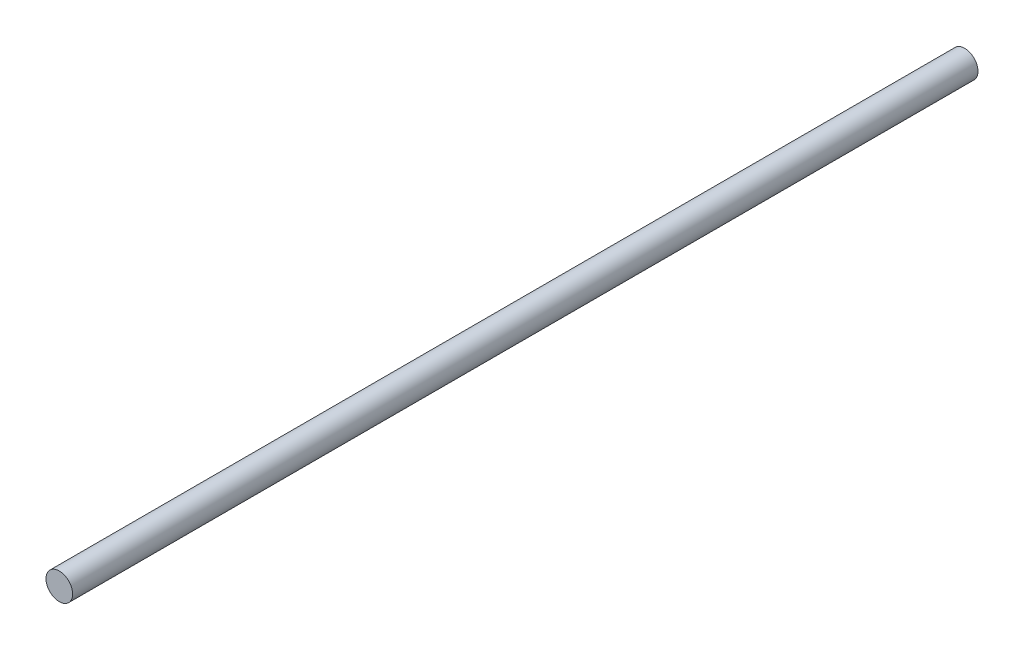
ISO-10303-21;
HEADER;
FILE_DESCRIPTION(('STEP AP214'),'2;1');
FILE_NAME('part.step','',(''),(''),'','','');
FILE_SCHEMA(('AUTOMOTIVE_DESIGN { 1 0 10303 214 1 1 1 1 }'));
ENDSEC;
DATA;
#1=APPLICATION_CONTEXT('core data for automotive mechanical design processes');
#2=APPLICATION_PROTOCOL_DEFINITION('international standard','automotive_design',2000,#1);
#3=PRODUCT_CONTEXT('',#1,'mechanical');
#4=PRODUCT('Part','Part','',(#3));
#5=PRODUCT_RELATED_PRODUCT_CATEGORY('part','',(#4));
#6=PRODUCT_DEFINITION_FORMATION('','',#4);
#7=PRODUCT_DEFINITION_CONTEXT('part definition',#1,'design');
#8=PRODUCT_DEFINITION('design','',#6,#7);
#9=PRODUCT_DEFINITION_SHAPE('','',#8);
#10=(LENGTH_UNIT() NAMED_UNIT(*) SI_UNIT(.MILLI.,.METRE.));
#11=(NAMED_UNIT(*) PLANE_ANGLE_UNIT() SI_UNIT($,.RADIAN.));
#12=(NAMED_UNIT(*) SI_UNIT($,.STERADIAN.) SOLID_ANGLE_UNIT());
#13=UNCERTAINTY_MEASURE_WITH_UNIT(LENGTH_MEASURE(1.E-05),#10,'distance_accuracy_value','');
#14=(GEOMETRIC_REPRESENTATION_CONTEXT(3) GLOBAL_UNCERTAINTY_ASSIGNED_CONTEXT((#13)) GLOBAL_UNIT_ASSIGNED_CONTEXT((#10,
#11,#12)) REPRESENTATION_CONTEXT('',''));
#15=CARTESIAN_POINT('',(0.,0.,0.));
#16=DIRECTION('',(0.,0.,1.));
#17=DIRECTION('',(1.,0.,0.));
#18=AXIS2_PLACEMENT_3D('',#15,#16,#17);
#19=CARTESIAN_POINT('',(0.,0.,34.));
#20=DIRECTION('',(0.,0.,-1.));
#21=DIRECTION('',(-1.,0.,0.));
#22=AXIS2_PLACEMENT_3D('',#19,#20,#21);
#23=CYLINDRICAL_SURFACE('',#22,0.5);
#24=CARTESIAN_POINT('',(0.,0.,34.));
#25=DIRECTION('',(0.,0.,1.));
#26=DIRECTION('',(1.,0.,0.));
#27=AXIS2_PLACEMENT_3D('',#24,#25,#26);
#28=CIRCLE('',#27,0.5);
#29=CARTESIAN_POINT('',(0.5,0.,34.));
#30=VERTEX_POINT('',#29);
#31=EDGE_CURVE('E10',#30,#30,#28,.T.);
#32=ORIENTED_EDGE('',*,*,#31,.F.);
#33=EDGE_LOOP('',(#32));
#34=FACE_BOUND('',#33,.T.);
#35=CARTESIAN_POINT('',(0.,0.,0.));
#36=DIRECTION('',(0.,0.,1.));
#37=DIRECTION('',(1.,0.,0.));
#38=AXIS2_PLACEMENT_3D('',#35,#36,#37);
#39=CIRCLE('',#38,0.5);
#40=CARTESIAN_POINT('',(0.5,0.,0.));
#41=VERTEX_POINT('',#40);
#42=EDGE_CURVE('E33',#41,#41,#39,.T.);
#43=ORIENTED_EDGE('',*,*,#42,.T.);
#44=EDGE_LOOP('',(#43));
#45=FACE_BOUND('',#44,.T.);
#46=ADVANCED_FACE('F30',(#34,#45),#23,.T.);
#47=CARTESIAN_POINT('',(0.,0.,34.));
#48=DIRECTION('',(0.,0.,1.));
#49=DIRECTION('',(1.,0.,0.));
#50=AXIS2_PLACEMENT_3D('',#47,#48,#49);
#51=PLANE('',#50);
#52=ORIENTED_EDGE('',*,*,#31,.T.);
#53=EDGE_LOOP('',(#52));
#54=FACE_BOUND('',#53,.T.);
#55=ADVANCED_FACE('F45',(#54),#51,.T.);
#56=CARTESIAN_POINT('',(0.,0.,0.));
#57=DIRECTION('',(0.,0.,1.));
#58=DIRECTION('',(1.,0.,0.));
#59=AXIS2_PLACEMENT_3D('',#56,#57,#58);
#60=PLANE('',#59);
#61=ORIENTED_EDGE('',*,*,#42,.F.);
#62=EDGE_LOOP('',(#61));
#63=FACE_BOUND('',#62,.T.);
#64=ADVANCED_FACE('F43',(#63),#60,.F.);
#65=CLOSED_SHELL('',(#46,#55,#64));
#66=MANIFOLD_SOLID_BREP('B2',#65);
#67=ADVANCED_BREP_SHAPE_REPRESENTATION('',(#18,#66),#14);
#68=SHAPE_DEFINITION_REPRESENTATION(#9,#67);
ENDSEC;
END-ISO-10303-21;
